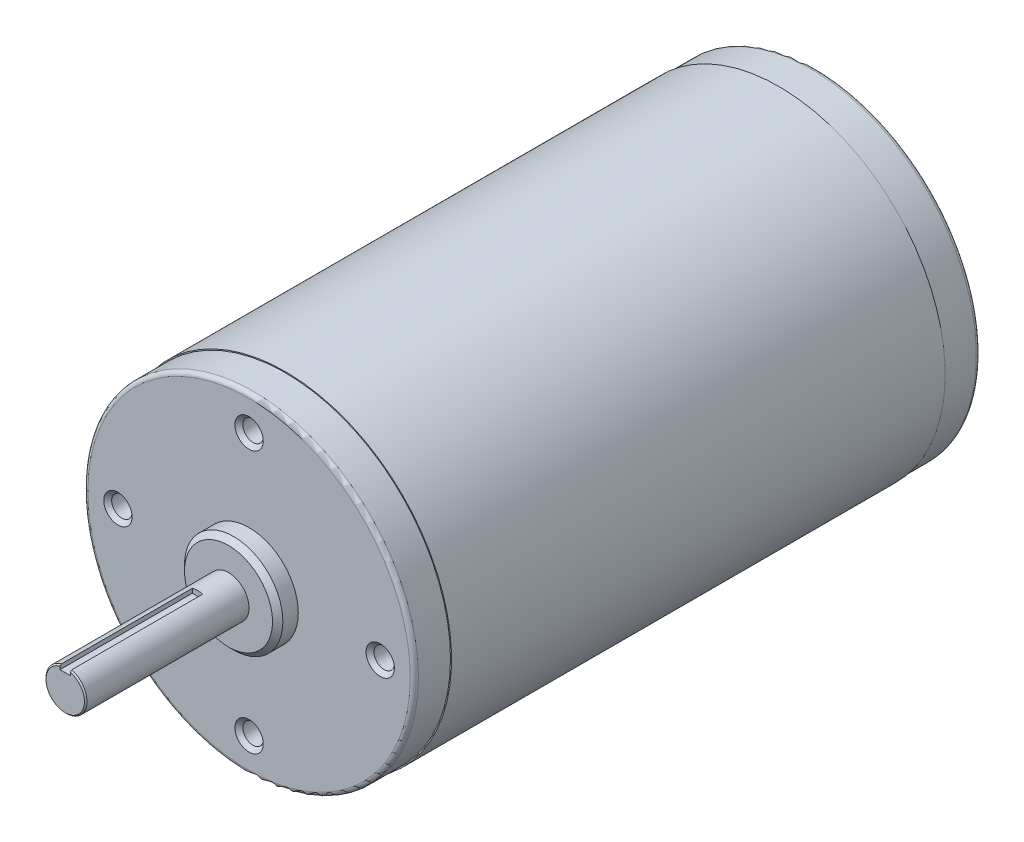
ISO-10303-21;
HEADER;
FILE_DESCRIPTION(('STEP AP214'),'2;1');
FILE_NAME('part.step','',(''),(''),'','','');
FILE_SCHEMA(('AUTOMOTIVE_DESIGN { 1 0 10303 214 1 1 1 1 }'));
ENDSEC;
DATA;
#1=APPLICATION_CONTEXT('core data for automotive mechanical design processes');
#2=APPLICATION_PROTOCOL_DEFINITION('international standard','automotive_design',2000,#1);
#3=PRODUCT_CONTEXT('',#1,'mechanical');
#4=PRODUCT('Part','Part','',(#3));
#5=PRODUCT_RELATED_PRODUCT_CATEGORY('part','',(#4));
#6=PRODUCT_DEFINITION_FORMATION('','',#4);
#7=PRODUCT_DEFINITION_CONTEXT('part definition',#1,'design');
#8=PRODUCT_DEFINITION('design','',#6,#7);
#9=PRODUCT_DEFINITION_SHAPE('','',#8);
#10=(LENGTH_UNIT() NAMED_UNIT(*) SI_UNIT(.MILLI.,.METRE.));
#11=(NAMED_UNIT(*) PLANE_ANGLE_UNIT() SI_UNIT($,.RADIAN.));
#12=(NAMED_UNIT(*) SI_UNIT($,.STERADIAN.) SOLID_ANGLE_UNIT());
#13=UNCERTAINTY_MEASURE_WITH_UNIT(LENGTH_MEASURE(1.E-05),#10,'distance_accuracy_value','');
#14=(GEOMETRIC_REPRESENTATION_CONTEXT(3) GLOBAL_UNCERTAINTY_ASSIGNED_CONTEXT((#13)) GLOBAL_UNIT_ASSIGNED_CONTEXT((#10,
#11,#12)) REPRESENTATION_CONTEXT('',''));
#15=CARTESIAN_POINT('',(0.,0.,0.));
#16=DIRECTION('',(0.,0.,1.));
#17=DIRECTION('',(1.,0.,0.));
#18=AXIS2_PLACEMENT_3D('',#15,#16,#17);
#19=CARTESIAN_POINT('',(0.,0.,42.6108));
#20=DIRECTION('',(0.,0.,-1.));
#21=DIRECTION('',(-1.,0.,0.));
#22=AXIS2_PLACEMENT_3D('',#19,#20,#21);
#23=PLANE('',#22);
#24=DIRECTION('',(0.,1.,0.));
#25=VECTOR('',#24,1.);
#26=CARTESIAN_POINT('',(1.00000000000001,0.,42.6108));
#27=LINE('',#26,#25);
#28=CARTESIAN_POINT('',(1.00000000000001,2.99999999999999,42.6108));
#29=VERTEX_POINT('',#28);
#30=CARTESIAN_POINT('',(1.00000000000001,3.58836592498397,42.6108000000454));
#31=VERTEX_POINT('',#30);
#32=EDGE_CURVE('E109',#29,#31,#27,.T.);
#33=ORIENTED_EDGE('',*,*,#32,.F.);
#34=DIRECTION('',(1.,0.,0.));
#35=VECTOR('',#34,1.);
#36=CARTESIAN_POINT('',(-0.999999999999988,2.99999999999999,42.6108));
#37=LINE('',#36,#35);
#38=CARTESIAN_POINT('',(-0.999999999999988,2.99999999999999,42.6108));
#39=VERTEX_POINT('',#38);
#40=EDGE_CURVE('E75',#29,#39,#37,.F.);
#41=ORIENTED_EDGE('',*,*,#40,.T.);
#42=DIRECTION('',(0.,1.,0.));
#43=VECTOR('',#42,1.);
#44=CARTESIAN_POINT('',(-0.999999999999988,0.,42.6108));
#45=LINE('',#44,#43);
#46=CARTESIAN_POINT('',(-0.999999999999988,3.58836592498397,42.6108000000454));
#47=VERTEX_POINT('',#46);
#48=EDGE_CURVE('E56',#47,#39,#45,.F.);
#49=ORIENTED_EDGE('',*,*,#48,.F.);
#50=CARTESIAN_POINT('',(0.,0.,42.6108000000909));
#51=DIRECTION('',(0.,0.,-1.));
#52=DIRECTION('',(-1.,0.,0.));
#53=AXIS2_PLACEMENT_3D('',#50,#51,#52);
#54=CIRCLE('',#53,3.72510000016746);
#55=EDGE_CURVE('E21',#31,#47,#54,.T.);
#56=ORIENTED_EDGE('',*,*,#55,.F.);
#57=EDGE_LOOP('',(#33,#41,#49,#56));
#58=FACE_BOUND('',#57,.T.);
#59=ADVANCED_FACE('F17',(#58),#23,.F.);
#60=CARTESIAN_POINT('',(-0.999999999999988,2.99999999999999,42.6108));
#61=DIRECTION('',(0.,-1.,0.));
#62=DIRECTION('',(0.,0.,-1.));
#63=AXIS2_PLACEMENT_3D('',#60,#61,#62);
#64=PLANE('',#63);
#65=DIRECTION('',(0.,0.,1.));
#66=VECTOR('',#65,1.);
#67=CARTESIAN_POINT('',(-0.999999999999988,2.99999999999999,42.6108));
#68=LINE('',#67,#66);
#69=CARTESIAN_POINT('',(-0.999999999999988,2.99999999999999,16.9822));
#70=VERTEX_POINT('',#69);
#71=EDGE_CURVE('E112',#70,#39,#68,.T.);
#72=ORIENTED_EDGE('',*,*,#71,.T.);
#73=ORIENTED_EDGE('',*,*,#40,.F.);
#74=DIRECTION('',(0.,0.,-1.));
#75=VECTOR('',#74,1.);
#76=CARTESIAN_POINT('',(1.00000000000001,2.99999999999999,42.6108));
#77=LINE('',#76,#75);
#78=CARTESIAN_POINT('',(1.00000000000001,2.99999999999999,16.9822));
#79=VERTEX_POINT('',#78);
#80=EDGE_CURVE('E71',#29,#79,#77,.T.);
#81=ORIENTED_EDGE('',*,*,#80,.T.);
#82=DIRECTION('',(1.,0.,0.));
#83=VECTOR('',#82,1.);
#84=CARTESIAN_POINT('',(0.,2.99999999999999,16.9822));
#85=LINE('',#84,#83);
#86=EDGE_CURVE('E74',#70,#79,#85,.T.);
#87=ORIENTED_EDGE('',*,*,#86,.F.);
#88=EDGE_LOOP('',(#72,#73,#81,#87));
#89=FACE_BOUND('',#88,.T.);
#90=ADVANCED_FACE('F73',(#89),#64,.F.);
#91=CARTESIAN_POINT('',(0.,0.,42.3607999999831));
#92=DIRECTION('',(0.,0.,-1.));
#93=DIRECTION('',(-1.,0.,0.));
#94=AXIS2_PLACEMENT_3D('',#91,#92,#93);
#95=CONICAL_SURFACE('',#94,3.97509999982049,0.785398162487954);
#96=CARTESIAN_POINT('',(1.00000000000001,3.84726136482105,42.3607999998986));
#97=CARTESIAN_POINT('',(1.00000000000001,3.80416108602024,42.4025173689466));
#98=CARTESIAN_POINT('',(1.00000000000001,3.76103632686847,42.4442093865898));
#99=CARTESIAN_POINT('',(1.00000000000001,3.6747378468958,42.5275427200003));
#100=CARTESIAN_POINT('',(1.00000000000001,3.63156412607381,42.5691840357664));
#101=CARTESIAN_POINT('',(1.00000000000001,3.58836592489976,42.6108000001266));
#102=B_SPLINE_CURVE_WITH_KNOTS('',3,(#96,#97,#98,#99,#100,#101),.UNSPECIFIED.,.F.,.F.,(4,2,4),
(0.,0.179949222514293,0.359898449062173),.UNSPECIFIED.);
#103=CARTESIAN_POINT('',(1.00000000000001,3.84726136487013,42.3607999999493));
#104=VERTEX_POINT('',#103);
#105=EDGE_CURVE('E89',#104,#31,#102,.T.);
#106=ORIENTED_EDGE('',*,*,#105,.T.);
#107=ORIENTED_EDGE('',*,*,#55,.T.);
#108=CARTESIAN_POINT('',(-0.999999999953149,3.58836592487288,42.6108000000988));
#109=CARTESIAN_POINT('',(-0.999999999976568,3.63156412606036,42.5691840357526));
#110=CARTESIAN_POINT('',(-0.999999999992181,3.67473784689131,42.5275427199957));
#111=CARTESIAN_POINT('',(-1.00000000000779,3.76103632687294,42.4442093865944));
#112=CARTESIAN_POINT('',(-1.00000000000779,3.80416108602471,42.4025173689513));
#113=CARTESIAN_POINT('',(-0.999999999999988,3.84726136482106,42.3607999998986));
#114=B_SPLINE_CURVE_WITH_KNOTS('',3,(#108,#109,#110,#111,#112,#113),.UNSPECIFIED.,.F.,.F.,(4,2,
4),(0.,0.17994922654793,0.359898449062241),.UNSPECIFIED.);
#115=CARTESIAN_POINT('',(-0.999999999999988,3.84726136487013,42.3607999999493));
#116=VERTEX_POINT('',#115);
#117=EDGE_CURVE('E82',#47,#116,#114,.T.);
#118=ORIENTED_EDGE('',*,*,#117,.T.);
#119=CARTESIAN_POINT('',(0.,0.,42.3608));
#120=DIRECTION('',(0.,0.,1.));
#121=DIRECTION('',(1.,0.,0.));
#122=AXIS2_PLACEMENT_3D('',#119,#120,#121);
#123=CIRCLE('',#122,3.9751);
#124=EDGE_CURVE('E92',#104,#116,#123,.F.);
#125=ORIENTED_EDGE('',*,*,#124,.F.);
#126=EDGE_LOOP('',(#106,#107,#118,#125));
#127=FACE_BOUND('',#126,.T.);
#128=ADVANCED_FACE('F200',(#127),#95,.T.);
#129=CARTESIAN_POINT('',(-0.999999999999988,3.84726136491921,42.6108));
#130=DIRECTION('',(-1.,0.,0.));
#131=DIRECTION('',(0.,0.,1.));
#132=AXIS2_PLACEMENT_3D('',#129,#130,#131);
#133=PLANE('',#132);
#134=ORIENTED_EDGE('',*,*,#48,.T.);
#135=ORIENTED_EDGE('',*,*,#71,.F.);
#136=DIRECTION('',(0.,1.,0.));
#137=VECTOR('',#136,1.);
#138=CARTESIAN_POINT('',(-0.999999999999988,3.45234055060212,16.9822));
#139=LINE('',#138,#137);
#140=CARTESIAN_POINT('',(-0.999999999999988,3.84726136491921,16.9822));
#141=VERTEX_POINT('',#140);
#142=EDGE_CURVE('E78',#141,#70,#139,.F.);
#143=ORIENTED_EDGE('',*,*,#142,.F.);
#144=DIRECTION('',(0.,0.,1.));
#145=VECTOR('',#144,1.);
#146=CARTESIAN_POINT('',(-0.999999999999988,3.84726136491921,10.9878));
#147=LINE('',#146,#145);
#148=EDGE_CURVE('E101',#116,#141,#147,.F.);
#149=ORIENTED_EDGE('',*,*,#148,.F.);
#150=ORIENTED_EDGE('',*,*,#117,.F.);
#151=EDGE_LOOP('',(#134,#135,#143,#149,#150));
#152=FACE_BOUND('',#151,.T.);
#153=ADVANCED_FACE('F204',(#152),#133,.F.);
#154=CARTESIAN_POINT('',(0.,3.45234055060212,16.9822));
#155=DIRECTION('',(0.,0.,1.));
#156=DIRECTION('',(1.,0.,0.));
#157=AXIS2_PLACEMENT_3D('',#154,#155,#156);
#158=PLANE('',#157);
#159=CARTESIAN_POINT('',(0.,0.,16.9822));
#160=DIRECTION('',(0.,0.,1.));
#161=DIRECTION('',(1.,0.,0.));
#162=AXIS2_PLACEMENT_3D('',#159,#160,#161);
#163=CIRCLE('',#162,3.9751);
#164=CARTESIAN_POINT('',(1.00000000000001,3.8472613649192,16.9822));
#165=VERTEX_POINT('',#164);
#166=EDGE_CURVE('E187',#141,#165,#163,.F.);
#167=ORIENTED_EDGE('',*,*,#166,.F.);
#168=ORIENTED_EDGE('',*,*,#142,.T.);
#169=ORIENTED_EDGE('',*,*,#86,.T.);
#170=DIRECTION('',(0.,1.,0.));
#171=VECTOR('',#170,1.);
#172=CARTESIAN_POINT('',(1.00000000000001,2.99999999999999,16.9822));
#173=LINE('',#172,#171);
#174=EDGE_CURVE('E36',#79,#165,#173,.T.);
#175=ORIENTED_EDGE('',*,*,#174,.T.);
#176=EDGE_LOOP('',(#167,#168,#169,#175));
#177=FACE_BOUND('',#176,.T.);
#178=ADVANCED_FACE('F81',(#177),#158,.T.);
#179=CARTESIAN_POINT('',(1.00000000000001,2.99999999999999,42.6108));
#180=DIRECTION('',(1.,0.,0.));
#181=DIRECTION('',(0.,0.,-1.));
#182=AXIS2_PLACEMENT_3D('',#179,#180,#181);
#183=PLANE('',#182);
#184=DIRECTION('',(0.,0.,1.));
#185=VECTOR('',#184,1.);
#186=CARTESIAN_POINT('',(1.00000000000001,3.8472613649192,10.9878));
#187=LINE('',#186,#185);
#188=EDGE_CURVE('E87',#165,#104,#187,.T.);
#189=ORIENTED_EDGE('',*,*,#188,.F.);
#190=ORIENTED_EDGE('',*,*,#174,.F.);
#191=ORIENTED_EDGE('',*,*,#80,.F.);
#192=ORIENTED_EDGE('',*,*,#32,.T.);
#193=ORIENTED_EDGE('',*,*,#105,.F.);
#194=EDGE_LOOP('',(#189,#190,#191,#192,#193));
#195=FACE_BOUND('',#194,.T.);
#196=ADVANCED_FACE('F84',(#195),#183,.F.);
#197=CARTESIAN_POINT('',(0.,25.4,-98.0336));
#198=DIRECTION('',(0.,0.,1.));
#199=DIRECTION('',(1.,0.,0.));
#200=AXIS2_PLACEMENT_3D('',#197,#198,#199);
#201=CYLINDRICAL_SURFACE('',#200,2.54);
#202=CARTESIAN_POINT('',(0.,25.4,-94.9856));
#203=DIRECTION('',(0.,0.,1.));
#204=DIRECTION('',(1.,0.,0.));
#205=AXIS2_PLACEMENT_3D('',#202,#203,#204);
#206=CIRCLE('',#205,2.53999999999997);
#207=CARTESIAN_POINT('',(2.53999999999998,25.4,-94.9856));
#208=VERTEX_POINT('',#207);
#209=EDGE_CURVE('E180',#208,#208,#206,.T.);
#210=ORIENTED_EDGE('',*,*,#209,.T.);
#211=EDGE_LOOP('',(#210));
#212=FACE_BOUND('',#211,.T.);
#213=CARTESIAN_POINT('',(0.,25.4,-98.0336));
#214=DIRECTION('',(0.,0.,1.));
#215=DIRECTION('',(1.,0.,0.));
#216=AXIS2_PLACEMENT_3D('',#213,#214,#215);
#217=CIRCLE('',#216,2.54);
#218=CARTESIAN_POINT('',(2.54,25.4,-98.0336));
#219=VERTEX_POINT('',#218);
#220=EDGE_CURVE('E181',#219,#219,#217,.F.);
#221=ORIENTED_EDGE('',*,*,#220,.T.);
#222=EDGE_LOOP('',(#221));
#223=FACE_BOUND('',#222,.T.);
#224=ADVANCED_FACE('F212',(#212,#223),#201,.F.);
#225=CARTESIAN_POINT('',(0.,0.,10.9878));
#226=DIRECTION('',(0.,0.,1.));
#227=DIRECTION('',(1.,0.,0.));
#228=AXIS2_PLACEMENT_3D('',#225,#226,#227);
#229=CYLINDRICAL_SURFACE('',#228,3.9751);
#230=CARTESIAN_POINT('',(0.,0.,10.9878));
#231=DIRECTION('',(0.,0.,1.));
#232=DIRECTION('',(1.,0.,0.));
#233=AXIS2_PLACEMENT_3D('',#230,#231,#232);
#234=CIRCLE('',#233,3.9751);
#235=CARTESIAN_POINT('',(3.9751,0.,10.9878));
#236=VERTEX_POINT('',#235);
#237=EDGE_CURVE('E177',#236,#236,#234,.T.);
#238=ORIENTED_EDGE('',*,*,#237,.T.);
#239=EDGE_LOOP('',(#238));
#240=FACE_BOUND('',#239,.T.);
#241=ORIENTED_EDGE('',*,*,#166,.T.);
#242=ORIENTED_EDGE('',*,*,#188,.T.);
#243=ORIENTED_EDGE('',*,*,#124,.T.);
#244=ORIENTED_EDGE('',*,*,#148,.T.);
#245=EDGE_LOOP('',(#241,#242,#243,#244));
#246=FACE_BOUND('',#245,.T.);
#247=ADVANCED_FACE('F215',(#240,#246),#229,.T.);
#248=CARTESIAN_POINT('',(0.,-25.4,-98.0336));
#249=DIRECTION('',(0.,0.,1.));
#250=DIRECTION('',(1.,0.,0.));
#251=AXIS2_PLACEMENT_3D('',#248,#249,#250);
#252=CYLINDRICAL_SURFACE('',#251,2.54);
#253=CARTESIAN_POINT('',(0.,-25.4,-94.9856));
#254=DIRECTION('',(0.,0.,1.));
#255=DIRECTION('',(1.,0.,0.));
#256=AXIS2_PLACEMENT_3D('',#253,#254,#255);
#257=CIRCLE('',#256,2.53999999999997);
#258=CARTESIAN_POINT('',(2.53999999999997,-25.4,-94.9856));
#259=VERTEX_POINT('',#258);
#260=EDGE_CURVE('E176',#259,#259,#257,.T.);
#261=ORIENTED_EDGE('',*,*,#260,.T.);
#262=EDGE_LOOP('',(#261));
#263=FACE_BOUND('',#262,.T.);
#264=CARTESIAN_POINT('',(0.,-25.4,-98.0336));
#265=DIRECTION('',(0.,0.,1.));
#266=DIRECTION('',(1.,0.,0.));
#267=AXIS2_PLACEMENT_3D('',#264,#265,#266);
#268=CIRCLE('',#267,2.54);
#269=CARTESIAN_POINT('',(2.54,-25.4,-98.0336));
#270=VERTEX_POINT('',#269);
#271=EDGE_CURVE('E184',#270,#270,#268,.F.);
#272=ORIENTED_EDGE('',*,*,#271,.T.);
#273=EDGE_LOOP('',(#272));
#274=FACE_BOUND('',#273,.T.);
#275=ADVANCED_FACE('F217',(#263,#274),#252,.F.);
#276=CARTESIAN_POINT('',(-5.05206,-30.45206,-98.0336));
#277=DIRECTION('',(0.,0.,1.));
#278=DIRECTION('',(1.,0.,0.));
#279=AXIS2_PLACEMENT_3D('',#276,#277,#278);
#280=PLANE('',#279);
#281=ORIENTED_EDGE('',*,*,#271,.F.);
#282=EDGE_LOOP('',(#281));
#283=FACE_BOUND('',#282,.T.);
#284=CARTESIAN_POINT('',(0.,-25.4,-98.0336));
#285=DIRECTION('',(0.,0.,1.));
#286=DIRECTION('',(1.,0.,0.));
#287=AXIS2_PLACEMENT_3D('',#284,#285,#286);
#288=CIRCLE('',#287,4.953);
#289=CARTESIAN_POINT('',(4.953,-25.4,-98.0336));
#290=VERTEX_POINT('',#289);
#291=EDGE_CURVE('E173',#290,#290,#288,.F.);
#292=ORIENTED_EDGE('',*,*,#291,.T.);
#293=EDGE_LOOP('',(#292));
#294=FACE_BOUND('',#293,.T.);
#295=ADVANCED_FACE('F220',(#283,#294),#280,.F.);
#296=CARTESIAN_POINT('',(0.,0.,-106.7204));
#297=DIRECTION('',(0.,0.,1.));
#298=DIRECTION('',(1.,0.,0.));
#299=AXIS2_PLACEMENT_3D('',#296,#297,#298);
#300=PLANE('',#299);
#301=CARTESIAN_POINT('',(0.,0.,-106.7204));
#302=DIRECTION('',(0.,0.,1.));
#303=DIRECTION('',(-1.,0.,0.));
#304=AXIS2_PLACEMENT_3D('',#301,#302,#303);
#305=CIRCLE('',#304,14.3129);
#306=CARTESIAN_POINT('',(-14.3129,0.,-106.7204));
#307=VERTEX_POINT('',#306);
#308=EDGE_CURVE('E172',#307,#307,#305,.T.);
#309=ORIENTED_EDGE('',*,*,#308,.F.);
#310=EDGE_LOOP('',(#309));
#311=FACE_BOUND('',#310,.T.);
#312=ADVANCED_FACE('F224',(#311),#300,.F.);
#313=CARTESIAN_POINT('',(5.05206,30.45206,-98.0336));
#314=DIRECTION('',(0.,0.,1.));
#315=DIRECTION('',(-1.,0.,0.));
#316=AXIS2_PLACEMENT_3D('',#313,#314,#315);
#317=PLANE('',#316);
#318=ORIENTED_EDGE('',*,*,#220,.F.);
#319=EDGE_LOOP('',(#318));
#320=FACE_BOUND('',#319,.T.);
#321=CARTESIAN_POINT('',(0.,25.4,-98.0336));
#322=DIRECTION('',(0.,0.,1.));
#323=DIRECTION('',(1.,0.,0.));
#324=AXIS2_PLACEMENT_3D('',#321,#322,#323);
#325=CIRCLE('',#324,4.953);
#326=CARTESIAN_POINT('',(4.953,25.4,-98.0336));
#327=VERTEX_POINT('',#326);
#328=EDGE_CURVE('E169',#327,#327,#325,.F.);
#329=ORIENTED_EDGE('',*,*,#328,.T.);
#330=EDGE_LOOP('',(#329));
#331=FACE_BOUND('',#330,.T.);
#332=ADVANCED_FACE('F226',(#320,#331),#317,.F.);
#333=CARTESIAN_POINT('',(0.,25.4,-94.9856));
#334=DIRECTION('',(0.,0.,-1.));
#335=DIRECTION('',(-1.,0.,0.));
#336=AXIS2_PLACEMENT_3D('',#333,#334,#335);
#337=CONICAL_SURFACE('',#336,2.53999999999997,1.02974425867669);
#338=ORIENTED_EDGE('',*,*,#209,.F.);
#339=EDGE_LOOP('',(#338));
#340=FACE_BOUND('',#339,.T.);
#341=CARTESIAN_POINT('',(0.,25.4,-94.6498390860874));
#342=DIRECTION('',(0.,0.,1.));
#343=DIRECTION('',(1.,0.,0.));
#344=AXIS2_PLACEMENT_3D('',#341,#342,#343);
#345=CIRCLE('',#344,1.9812);
#346=CARTESIAN_POINT('',(1.9812,25.4,-94.6498390860874));
#347=VERTEX_POINT('',#346);
#348=EDGE_CURVE('E168',#347,#347,#345,.T.);
#349=ORIENTED_EDGE('',*,*,#348,.T.);
#350=EDGE_LOOP('',(#349));
#351=FACE_BOUND('',#350,.T.);
#352=ADVANCED_FACE('F229',(#340,#351),#337,.F.);
#353=CARTESIAN_POINT('',(0.,0.,-95.6056));
#354=DIRECTION('',(0.,0.,1.));
#355=DIRECTION('',(1.,0.,0.));
#356=AXIS2_PLACEMENT_3D('',#353,#354,#355);
#357=PLANE('',#356);
#358=CARTESIAN_POINT('',(25.4,0.,-95.6056));
#359=DIRECTION('',(0.,0.,-1.));
#360=DIRECTION('',(-1.,0.,0.));
#361=AXIS2_PLACEMENT_3D('',#358,#359,#360);
#362=CIRCLE('',#361,1.9812);
#363=CARTESIAN_POINT('',(23.4188,0.,-95.6056));
#364=VERTEX_POINT('',#363);
#365=EDGE_CURVE('E165',#364,#364,#362,.F.);
#366=ORIENTED_EDGE('',*,*,#365,.T.);
#367=EDGE_LOOP('',(#366));
#368=FACE_BOUND('',#367,.T.);
#369=ADVANCED_FACE('F233',(#368),#357,.T.);
#370=CARTESIAN_POINT('',(0.,0.,10.9878));
#371=DIRECTION('',(0.,0.,-1.));
#372=DIRECTION('',(-1.,0.,0.));
#373=AXIS2_PLACEMENT_3D('',#370,#371,#372);
#374=PLANE('',#373);
#375=ORIENTED_EDGE('',*,*,#237,.F.);
#376=EDGE_LOOP('',(#375));
#377=FACE_BOUND('',#376,.T.);
#378=CARTESIAN_POINT('',(0.,0.,10.9878000004487));
#379=DIRECTION('',(0.,0.,-1.));
#380=DIRECTION('',(-1.,0.,0.));
#381=AXIS2_PLACEMENT_3D('',#378,#379,#380);
#382=CIRCLE('',#381,8.52500000044874);
#383=CARTESIAN_POINT('',(-8.52500000044874,0.,10.9878000004487));
#384=VERTEX_POINT('',#383);
#385=EDGE_CURVE('E162',#384,#384,#382,.T.);
#386=ORIENTED_EDGE('',*,*,#385,.F.);
#387=EDGE_LOOP('',(#386));
#388=FACE_BOUND('',#387,.T.);
#389=ADVANCED_FACE('F239',(#377,#388),#374,.F.);
#390=CARTESIAN_POINT('',(0.,-25.4,-94.9856));
#391=DIRECTION('',(0.,0.,-1.));
#392=DIRECTION('',(-1.,0.,0.));
#393=AXIS2_PLACEMENT_3D('',#390,#391,#392);
#394=CONICAL_SURFACE('',#393,2.53999999999997,1.02974425867669);
#395=ORIENTED_EDGE('',*,*,#260,.F.);
#396=EDGE_LOOP('',(#395));
#397=FACE_BOUND('',#396,.T.);
#398=CARTESIAN_POINT('',(0.,-25.4,-94.6498390860874));
#399=DIRECTION('',(0.,0.,1.));
#400=DIRECTION('',(1.,0.,0.));
#401=AXIS2_PLACEMENT_3D('',#398,#399,#400);
#402=CIRCLE('',#401,1.9812);
#403=CARTESIAN_POINT('',(1.98119999999999,-25.4,-94.6498390860874));
#404=VERTEX_POINT('',#403);
#405=EDGE_CURVE('E161',#404,#404,#402,.T.);
#406=ORIENTED_EDGE('',*,*,#405,.T.);
#407=EDGE_LOOP('',(#406));
#408=FACE_BOUND('',#407,.T.);
#409=ADVANCED_FACE('F235',(#397,#408),#394,.F.);
#410=CARTESIAN_POINT('',(0.,0.,0.));
#411=DIRECTION('',(0.,0.,1.));
#412=DIRECTION('',(1.,0.,0.));
#413=AXIS2_PLACEMENT_3D('',#410,#411,#412);
#414=PLANE('',#413);
#415=CARTESIAN_POINT('',(-25.4,0.,0.));
#416=DIRECTION('',(0.,0.,-1.));
#417=DIRECTION('',(0.,1.,0.));
#418=AXIS2_PLACEMENT_3D('',#415,#416,#417);
#419=CIRCLE('',#418,1.9812);
#420=CARTESIAN_POINT('',(-25.4,1.9812,0.));
#421=VERTEX_POINT('',#420);
#422=EDGE_CURVE('E157',#421,#421,#419,.F.);
#423=ORIENTED_EDGE('',*,*,#422,.T.);
#424=EDGE_LOOP('',(#423));
#425=FACE_BOUND('',#424,.T.);
#426=ADVANCED_FACE('F238',(#425),#414,.T.);
#427=CARTESIAN_POINT('',(0.,-25.4,-102.0976));
#428=DIRECTION('',(0.,0.,1.));
#429=DIRECTION('',(1.,0.,0.));
#430=AXIS2_PLACEMENT_3D('',#427,#428,#429);
#431=CYLINDRICAL_SURFACE('',#430,4.953);
#432=CARTESIAN_POINT('',(0.,-25.4,-102.097599999809));
#433=DIRECTION('',(0.,0.,-1.));
#434=DIRECTION('',(-1.,0.,0.));
#435=AXIS2_PLACEMENT_3D('',#432,#433,#434);
#436=CIRCLE('',#435,4.9530000002278);
#437=CARTESIAN_POINT('',(-4.9530000002278,-25.4,-102.097599999809));
#438=VERTEX_POINT('',#437);
#439=EDGE_CURVE('E160',#438,#438,#436,.T.);
#440=ORIENTED_EDGE('',*,*,#439,.T.);
#441=EDGE_LOOP('',(#440));
#442=FACE_BOUND('',#441,.T.);
#443=ORIENTED_EDGE('',*,*,#291,.F.);
#444=EDGE_LOOP('',(#443));
#445=FACE_BOUND('',#444,.T.);
#446=ADVANCED_FACE('F241',(#442,#445),#431,.F.);
#447=CARTESIAN_POINT('',(0.,0.,-105.9584));
#448=DIRECTION('',(0.,0.,1.));
#449=DIRECTION('',(1.,0.,0.));
#450=AXIS2_PLACEMENT_3D('',#447,#448,#449);
#451=TOROIDAL_SURFACE('',#450,14.3129,0.762);
#452=CARTESIAN_POINT('',(0.,0.,-105.9584));
#453=DIRECTION('',(0.,0.,-1.));
#454=DIRECTION('',(-1.,0.,0.));
#455=AXIS2_PLACEMENT_3D('',#452,#453,#454);
#456=CIRCLE('',#455,15.0749);
#457=CARTESIAN_POINT('',(-15.0749,0.,-105.9584));
#458=VERTEX_POINT('',#457);
#459=EDGE_CURVE('E386',#458,#458,#456,.F.);
#460=ORIENTED_EDGE('',*,*,#459,.F.);
#461=EDGE_LOOP('',(#460));
#462=FACE_BOUND('',#461,.T.);
#463=ORIENTED_EDGE('',*,*,#308,.T.);
#464=EDGE_LOOP('',(#463));
#465=FACE_BOUND('',#464,.T.);
#466=ADVANCED_FACE('F244',(#462,#465),#451,.T.);
#467=CARTESIAN_POINT('',(0.,25.4,-102.0976));
#468=DIRECTION('',(0.,0.,1.));
#469=DIRECTION('',(1.,0.,0.));
#470=AXIS2_PLACEMENT_3D('',#467,#468,#469);
#471=CYLINDRICAL_SURFACE('',#470,4.953);
#472=CARTESIAN_POINT('',(0.,25.4,-102.097599999809));
#473=DIRECTION('',(0.,0.,-1.));
#474=DIRECTION('',(1.,0.,0.));
#475=AXIS2_PLACEMENT_3D('',#472,#473,#474);
#476=CIRCLE('',#475,4.9530000002278);
#477=CARTESIAN_POINT('',(4.9530000002278,25.4,-102.097599999809));
#478=VERTEX_POINT('',#477);
#479=EDGE_CURVE('E381',#478,#478,#476,.T.);
#480=ORIENTED_EDGE('',*,*,#479,.T.);
#481=EDGE_LOOP('',(#480));
#482=FACE_BOUND('',#481,.T.);
#483=ORIENTED_EDGE('',*,*,#328,.F.);
#484=EDGE_LOOP('',(#483));
#485=FACE_BOUND('',#484,.T.);
#486=ADVANCED_FACE('F246',(#482,#485),#471,.F.);
#487=CARTESIAN_POINT('',(0.,25.4,6.23799999999999));
#488=DIRECTION('',(0.,0.,-1.));
#489=DIRECTION('',(-1.,0.,0.));
#490=AXIS2_PLACEMENT_3D('',#487,#488,#489);
#491=CYLINDRICAL_SURFACE('',#490,1.9812);
#492=CARTESIAN_POINT('',(0.,25.4,6.23799999959829));
#493=DIRECTION('',(0.,0.,1.));
#494=DIRECTION('',(0.,-1.,0.));
#495=AXIS2_PLACEMENT_3D('',#492,#493,#494);
#496=CIRCLE('',#495,1.98120000033932);
#497=CARTESIAN_POINT('',(0.,23.4187999996607,6.23799999959829));
#498=VERTEX_POINT('',#497);
#499=EDGE_CURVE('E376',#498,#498,#496,.T.);
#500=ORIENTED_EDGE('',*,*,#499,.T.);
#501=EDGE_LOOP('',(#500));
#502=FACE_BOUND('',#501,.T.);
#503=ORIENTED_EDGE('',*,*,#348,.F.);
#504=EDGE_LOOP('',(#503));
#505=FACE_BOUND('',#504,.T.);
#506=ADVANCED_FACE('F249',(#502,#505),#491,.F.);
#507=CARTESIAN_POINT('',(25.4,0.,6.23799999999999));
#508=DIRECTION('',(0.,0.,-1.));
#509=DIRECTION('',(-1.,0.,0.));
#510=AXIS2_PLACEMENT_3D('',#507,#508,#509);
#511=CYLINDRICAL_SURFACE('',#510,1.9812);
#512=CARTESIAN_POINT('',(25.4,0.,6.23799999959829));
#513=DIRECTION('',(0.,0.,1.));
#514=DIRECTION('',(-1.,0.,0.));
#515=AXIS2_PLACEMENT_3D('',#512,#513,#514);
#516=CIRCLE('',#515,1.98120000033932);
#517=CARTESIAN_POINT('',(23.4187999996607,0.,6.23799999959829));
#518=VERTEX_POINT('',#517);
#519=EDGE_CURVE('E371',#518,#518,#516,.T.);
#520=ORIENTED_EDGE('',*,*,#519,.T.);
#521=EDGE_LOOP('',(#520));
#522=FACE_BOUND('',#521,.T.);
#523=ORIENTED_EDGE('',*,*,#365,.F.);
#524=EDGE_LOOP('',(#523));
#525=FACE_BOUND('',#524,.T.);
#526=ADVANCED_FACE('F253',(#522,#525),#511,.F.);
#527=CARTESIAN_POINT('',(0.,0.,9.98779999955128));
#528=DIRECTION('',(0.,0.,-1.));
#529=DIRECTION('',(-1.,0.,0.));
#530=AXIS2_PLACEMENT_3D('',#527,#528,#529);
#531=CONICAL_SURFACE('',#530,9.52499999955128,0.7853981625);
#532=CARTESIAN_POINT('',(0.,0.,9.9878));
#533=DIRECTION('',(0.,0.,1.));
#534=DIRECTION('',(1.,0.,0.));
#535=AXIS2_PLACEMENT_3D('',#532,#533,#534);
#536=CIRCLE('',#535,9.525);
#537=CARTESIAN_POINT('',(9.525,0.,9.9878));
#538=VERTEX_POINT('',#537);
#539=EDGE_CURVE('E366',#538,#538,#536,.F.);
#540=ORIENTED_EDGE('',*,*,#539,.F.);
#541=EDGE_LOOP('',(#540));
#542=FACE_BOUND('',#541,.T.);
#543=ORIENTED_EDGE('',*,*,#385,.T.);
#544=EDGE_LOOP('',(#543));
#545=FACE_BOUND('',#544,.T.);
#546=ADVANCED_FACE('F256',(#542,#545),#531,.T.);
#547=CARTESIAN_POINT('',(0.,-25.4,6.23799999999999));
#548=DIRECTION('',(0.,0.,-1.));
#549=DIRECTION('',(-1.,0.,0.));
#550=AXIS2_PLACEMENT_3D('',#547,#548,#549);
#551=CYLINDRICAL_SURFACE('',#550,1.9812);
#552=CARTESIAN_POINT('',(0.,-25.4,6.23799999959829));
#553=DIRECTION('',(0.,0.,1.));
#554=DIRECTION('',(0.,1.,0.));
#555=AXIS2_PLACEMENT_3D('',#552,#553,#554);
#556=CIRCLE('',#555,1.98120000033932);
#557=CARTESIAN_POINT('',(0.,-23.4187999996607,6.23799999959829));
#558=VERTEX_POINT('',#557);
#559=EDGE_CURVE('E362',#558,#558,#556,.T.);
#560=ORIENTED_EDGE('',*,*,#559,.T.);
#561=EDGE_LOOP('',(#560));
#562=FACE_BOUND('',#561,.T.);
#563=ORIENTED_EDGE('',*,*,#405,.F.);
#564=EDGE_LOOP('',(#563));
#565=FACE_BOUND('',#564,.T.);
#566=ADVANCED_FACE('F258',(#562,#565),#551,.F.);
#567=CARTESIAN_POINT('',(-25.4,0.,6.23799999999999));
#568=DIRECTION('',(0.,0.,-1.));
#569=DIRECTION('',(0.,1.,0.));
#570=AXIS2_PLACEMENT_3D('',#567,#568,#569);
#571=CYLINDRICAL_SURFACE('',#570,1.9812);
#572=CARTESIAN_POINT('',(-25.4,0.,6.23799999959829));
#573=DIRECTION('',(0.,0.,1.));
#574=DIRECTION('',(1.,0.,0.));
#575=AXIS2_PLACEMENT_3D('',#572,#573,#574);
#576=CIRCLE('',#575,1.98120000033932);
#577=CARTESIAN_POINT('',(-23.4187999996607,0.,6.23799999959829));
#578=VERTEX_POINT('',#577);
#579=EDGE_CURVE('E156',#578,#578,#576,.T.);
#580=ORIENTED_EDGE('',*,*,#579,.T.);
#581=EDGE_LOOP('',(#580));
#582=FACE_BOUND('',#581,.T.);
#583=ORIENTED_EDGE('',*,*,#422,.F.);
#584=EDGE_LOOP('',(#583));
#585=FACE_BOUND('',#584,.T.);
#586=ADVANCED_FACE('F19',(#582,#585),#571,.F.);
#587=CARTESIAN_POINT('',(0.,-25.4,-102.605600000174));
#588=DIRECTION('',(0.,0.,-1.));
#589=DIRECTION('',(0.,1.,0.));
#590=AXIS2_PLACEMENT_3D('',#587,#588,#589);
#591=CONICAL_SURFACE('',#590,5.46099999962735,0.785398162502275);
#592=CARTESIAN_POINT('',(0.,-25.4,-102.605600000288));
#593=DIRECTION('',(0.,0.,-1.));
#594=DIRECTION('',(0.,1.,0.));
#595=AXIS2_PLACEMENT_3D('',#592,#593,#594);
#596=CIRCLE('',#595,5.46099999974103);
#597=CARTESIAN_POINT('',(0.,-19.939000000259,-102.605600000288));
#598=VERTEX_POINT('',#597);
#599=EDGE_CURVE('E153',#598,#598,#596,.T.);
#600=ORIENTED_EDGE('',*,*,#599,.T.);
#601=EDGE_LOOP('',(#600));
#602=FACE_BOUND('',#601,.T.);
#603=ORIENTED_EDGE('',*,*,#439,.F.);
#604=EDGE_LOOP('',(#603));
#605=FACE_BOUND('',#604,.T.);
#606=ADVANCED_FACE('F266',(#602,#605),#591,.F.);
#607=CARTESIAN_POINT('',(0.,0.,-102.6056));
#608=DIRECTION('',(0.,0.,-1.));
#609=DIRECTION('',(-1.,0.,0.));
#610=AXIS2_PLACEMENT_3D('',#607,#608,#609);
#611=CYLINDRICAL_SURFACE('',#610,15.0749);
#612=ORIENTED_EDGE('',*,*,#459,.T.);
#613=EDGE_LOOP('',(#612));
#614=FACE_BOUND('',#613,.T.);
#615=CARTESIAN_POINT('',(0.,0.,-102.6056));
#616=DIRECTION('',(0.,0.,-1.));
#617=DIRECTION('',(-1.,0.,0.));
#618=AXIS2_PLACEMENT_3D('',#615,#616,#617);
#619=CIRCLE('',#618,15.0749);
#620=CARTESIAN_POINT('',(-15.0749,0.,-102.6056));
#621=VERTEX_POINT('',#620);
#622=EDGE_CURVE('E150',#621,#621,#619,.T.);
#623=ORIENTED_EDGE('',*,*,#622,.T.);
#624=EDGE_LOOP('',(#623));
#625=FACE_BOUND('',#624,.T.);
#626=ADVANCED_FACE('F545',(#614,#625),#611,.T.);
#627=CARTESIAN_POINT('',(0.,25.4,-102.605600000174));
#628=DIRECTION('',(0.,0.,-1.));
#629=DIRECTION('',(0.,1.,0.));
#630=AXIS2_PLACEMENT_3D('',#627,#628,#629);
#631=CONICAL_SURFACE('',#630,5.46099999962734,0.785398162502276);
#632=CARTESIAN_POINT('',(0.,25.4,-102.605600000288));
#633=DIRECTION('',(0.,0.,-1.));
#634=DIRECTION('',(0.,1.,0.));
#635=AXIS2_PLACEMENT_3D('',#632,#633,#634);
#636=CIRCLE('',#635,5.46099999974103);
#637=CARTESIAN_POINT('',(0.,30.860999999741,-102.605600000288));
#638=VERTEX_POINT('',#637);
#639=EDGE_CURVE('E147',#638,#638,#636,.T.);
#640=ORIENTED_EDGE('',*,*,#639,.T.);
#641=EDGE_LOOP('',(#640));
#642=FACE_BOUND('',#641,.T.);
#643=ORIENTED_EDGE('',*,*,#479,.F.);
#644=EDGE_LOOP('',(#643));
#645=FACE_BOUND('',#644,.T.);
#646=ADVANCED_FACE('F554',(#642,#645),#631,.F.);
#647=CARTESIAN_POINT('',(0.,25.4,7.00000000034606));
#648=DIRECTION('',(0.,0.,1.));
#649=DIRECTION('',(1.,0.,0.));
#650=AXIS2_PLACEMENT_3D('',#647,#648,#649);
#651=CONICAL_SURFACE('',#650,2.74319999966602,0.785398162464978);
#652=CARTESIAN_POINT('',(0.,25.4,7.00000000034606));
#653=DIRECTION('',(0.,0.,1.));
#654=DIRECTION('',(1.,0.,0.));
#655=AXIS2_PLACEMENT_3D('',#652,#653,#654);
#656=CIRCLE('',#655,2.74319999966602);
#657=CARTESIAN_POINT('',(2.74319999966602,25.4,7.00000000034606));
#658=VERTEX_POINT('',#657);
#659=EDGE_CURVE('E144',#658,#658,#656,.T.);
#660=ORIENTED_EDGE('',*,*,#659,.T.);
#661=EDGE_LOOP('',(#660));
#662=FACE_BOUND('',#661,.T.);
#663=ORIENTED_EDGE('',*,*,#499,.F.);
#664=EDGE_LOOP('',(#663));
#665=FACE_BOUND('',#664,.T.);
#666=ADVANCED_FACE('F564',(#662,#665),#651,.F.);
#667=CARTESIAN_POINT('',(25.4,0.,7.00000000034606));
#668=DIRECTION('',(0.,0.,1.));
#669=DIRECTION('',(1.,0.,0.));
#670=AXIS2_PLACEMENT_3D('',#667,#668,#669);
#671=CONICAL_SURFACE('',#670,2.74319999966602,0.785398162464978);
#672=CARTESIAN_POINT('',(25.4,0.,7.00000000034606));
#673=DIRECTION('',(0.,0.,1.));
#674=DIRECTION('',(1.,0.,0.));
#675=AXIS2_PLACEMENT_3D('',#672,#673,#674);
#676=CIRCLE('',#675,2.74319999966602);
#677=CARTESIAN_POINT('',(28.143199999666,0.,7.00000000034606));
#678=VERTEX_POINT('',#677);
#679=EDGE_CURVE('E141',#678,#678,#676,.T.);
#680=ORIENTED_EDGE('',*,*,#679,.T.);
#681=EDGE_LOOP('',(#680));
#682=FACE_BOUND('',#681,.T.);
#683=ORIENTED_EDGE('',*,*,#519,.F.);
#684=EDGE_LOOP('',(#683));
#685=FACE_BOUND('',#684,.T.);
#686=ADVANCED_FACE('F574',(#682,#685),#671,.F.);
#687=CARTESIAN_POINT('',(0.,0.,6.99999999999999));
#688=DIRECTION('',(0.,0.,1.));
#689=DIRECTION('',(1.,0.,0.));
#690=AXIS2_PLACEMENT_3D('',#687,#688,#689);
#691=CYLINDRICAL_SURFACE('',#690,9.525);
#692=ORIENTED_EDGE('',*,*,#539,.T.);
#693=EDGE_LOOP('',(#692));
#694=FACE_BOUND('',#693,.T.);
#695=CARTESIAN_POINT('',(0.,0.,6.99999999999999));
#696=DIRECTION('',(0.,0.,1.));
#697=DIRECTION('',(1.,0.,0.));
#698=AXIS2_PLACEMENT_3D('',#695,#696,#697);
#699=CIRCLE('',#698,9.525);
#700=CARTESIAN_POINT('',(9.525,0.,6.99999999999999));
#701=VERTEX_POINT('',#700);
#702=EDGE_CURVE('E138',#701,#701,#699,.T.);
#703=ORIENTED_EDGE('',*,*,#702,.T.);
#704=EDGE_LOOP('',(#703));
#705=FACE_BOUND('',#704,.T.);
#706=ADVANCED_FACE('F584',(#694,#705),#691,.T.);
#707=CARTESIAN_POINT('',(0.,-25.4,7.00000000034606));
#708=DIRECTION('',(0.,0.,1.));
#709=DIRECTION('',(1.,0.,0.));
#710=AXIS2_PLACEMENT_3D('',#707,#708,#709);
#711=CONICAL_SURFACE('',#710,2.74319999966602,0.785398162464978);
#712=CARTESIAN_POINT('',(0.,-25.4,7.00000000034606));
#713=DIRECTION('',(0.,0.,1.));
#714=DIRECTION('',(1.,0.,0.));
#715=AXIS2_PLACEMENT_3D('',#712,#713,#714);
#716=CIRCLE('',#715,2.74319999966602);
#717=CARTESIAN_POINT('',(2.74319999966601,-25.4,7.00000000034606));
#718=VERTEX_POINT('',#717);
#719=EDGE_CURVE('E135',#718,#718,#716,.T.);
#720=ORIENTED_EDGE('',*,*,#719,.T.);
#721=EDGE_LOOP('',(#720));
#722=FACE_BOUND('',#721,.T.);
#723=ORIENTED_EDGE('',*,*,#559,.F.);
#724=EDGE_LOOP('',(#723));
#725=FACE_BOUND('',#724,.T.);
#726=ADVANCED_FACE('F594',(#722,#725),#711,.F.);
#727=CARTESIAN_POINT('',(-25.4,0.,7.00000000034606));
#728=DIRECTION('',(0.,0.,1.));
#729=DIRECTION('',(1.,0.,0.));
#730=AXIS2_PLACEMENT_3D('',#727,#728,#729);
#731=CONICAL_SURFACE('',#730,2.74319999966602,0.785398162464978);
#732=CARTESIAN_POINT('',(-25.4,0.,7.00000000034606));
#733=DIRECTION('',(0.,0.,1.));
#734=DIRECTION('',(1.,0.,0.));
#735=AXIS2_PLACEMENT_3D('',#732,#733,#734);
#736=CIRCLE('',#735,2.74319999966602);
#737=CARTESIAN_POINT('',(-22.656800000334,0.,7.00000000034606));
#738=VERTEX_POINT('',#737);
#739=EDGE_CURVE('E131',#738,#738,#736,.T.);
#740=ORIENTED_EDGE('',*,*,#739,.T.);
#741=EDGE_LOOP('',(#740));
#742=FACE_BOUND('',#741,.T.);
#743=ORIENTED_EDGE('',*,*,#579,.F.);
#744=EDGE_LOOP('',(#743));
#745=FACE_BOUND('',#744,.T.);
#746=ADVANCED_FACE('F335',(#742,#745),#731,.F.);
#747=CARTESIAN_POINT('',(0.,0.,-102.6056));
#748=DIRECTION('',(0.,0.,1.));
#749=DIRECTION('',(1.,0.,0.));
#750=AXIS2_PLACEMENT_3D('',#747,#748,#749);
#751=PLANE('',#750);
#752=ORIENTED_EDGE('',*,*,#639,.F.);
#753=EDGE_LOOP('',(#752));
#754=FACE_BOUND('',#753,.T.);
#755=ORIENTED_EDGE('',*,*,#622,.F.);
#756=EDGE_LOOP('',(#755));
#757=FACE_BOUND('',#756,.T.);
#758=ORIENTED_EDGE('',*,*,#599,.F.);
#759=EDGE_LOOP('',(#758));
#760=FACE_BOUND('',#759,.T.);
#761=CARTESIAN_POINT('',(0.,0.,-102.6056));
#762=DIRECTION('',(0.,0.,1.));
#763=DIRECTION('',(-1.,0.,0.));
#764=AXIS2_PLACEMENT_3D('',#761,#762,#763);
#765=CIRCLE('',#764,31.242);
#766=CARTESIAN_POINT('',(-31.242,0.,-102.6056));
#767=VERTEX_POINT('',#766);
#768=EDGE_CURVE('E134',#767,#767,#765,.T.);
#769=ORIENTED_EDGE('',*,*,#768,.F.);
#770=EDGE_LOOP('',(#769));
#771=FACE_BOUND('',#770,.T.);
#772=ADVANCED_FACE('F330',(#754,#757,#760,#771),#751,.F.);
#773=CARTESIAN_POINT('',(0.,0.,6.99999999999999));
#774=DIRECTION('',(0.,0.,-1.));
#775=DIRECTION('',(-1.,0.,0.));
#776=AXIS2_PLACEMENT_3D('',#773,#774,#775);
#777=PLANE('',#776);
#778=ORIENTED_EDGE('',*,*,#739,.F.);
#779=EDGE_LOOP('',(#778));
#780=FACE_BOUND('',#779,.T.);
#781=ORIENTED_EDGE('',*,*,#719,.F.);
#782=EDGE_LOOP('',(#781));
#783=FACE_BOUND('',#782,.T.);
#784=ORIENTED_EDGE('',*,*,#702,.F.);
#785=EDGE_LOOP('',(#784));
#786=FACE_BOUND('',#785,.T.);
#787=ORIENTED_EDGE('',*,*,#679,.F.);
#788=EDGE_LOOP('',(#787));
#789=FACE_BOUND('',#788,.T.);
#790=ORIENTED_EDGE('',*,*,#659,.F.);
#791=EDGE_LOOP('',(#790));
#792=FACE_BOUND('',#791,.T.);
#793=CARTESIAN_POINT('',(0.,0.,6.99999999999999));
#794=DIRECTION('',(0.,0.,-1.));
#795=DIRECTION('',(1.,0.,0.));
#796=AXIS2_PLACEMENT_3D('',#793,#794,#795);
#797=CIRCLE('',#796,31.21025);
#798=CARTESIAN_POINT('',(31.21025,0.,6.99999999999999));
#799=VERTEX_POINT('',#798);
#800=EDGE_CURVE('E317',#799,#799,#797,.T.);
#801=ORIENTED_EDGE('',*,*,#800,.F.);
#802=EDGE_LOOP('',(#801));
#803=FACE_BOUND('',#802,.T.);
#804=ADVANCED_FACE('F321',(#780,#783,#786,#789,#792,#803),#777,.F.);
#805=CARTESIAN_POINT('',(0.,0.,-101.8436));
#806=DIRECTION('',(0.,0.,1.));
#807=DIRECTION('',(1.,0.,0.));
#808=AXIS2_PLACEMENT_3D('',#805,#806,#807);
#809=TOROIDAL_SURFACE('',#808,31.242,0.762);
#810=CARTESIAN_POINT('',(0.,0.,-101.8436));
#811=DIRECTION('',(0.,0.,-1.));
#812=DIRECTION('',(-1.,0.,0.));
#813=AXIS2_PLACEMENT_3D('',#810,#811,#812);
#814=CIRCLE('',#813,32.004);
#815=CARTESIAN_POINT('',(-32.004,0.,-101.8436));
#816=VERTEX_POINT('',#815);
#817=EDGE_CURVE('E783',#816,#816,#814,.F.);
#818=ORIENTED_EDGE('',*,*,#817,.F.);
#819=EDGE_LOOP('',(#818));
#820=FACE_BOUND('',#819,.T.);
#821=ORIENTED_EDGE('',*,*,#768,.T.);
#822=EDGE_LOOP('',(#821));
#823=FACE_BOUND('',#822,.T.);
#824=ADVANCED_FACE('F301',(#820,#823),#809,.T.);
#825=CARTESIAN_POINT('',(0.,0.,6.20624999999999));
#826=DIRECTION('',(0.,0.,-1.));
#827=DIRECTION('',(-1.,0.,0.));
#828=AXIS2_PLACEMENT_3D('',#825,#826,#827);
#829=TOROIDAL_SURFACE('',#828,31.21025,0.79375);
#830=CARTESIAN_POINT('',(0.,0.,6.20624999999999));
#831=DIRECTION('',(0.,0.,1.));
#832=DIRECTION('',(1.,0.,0.));
#833=AXIS2_PLACEMENT_3D('',#830,#831,#832);
#834=CIRCLE('',#833,32.004);
#835=CARTESIAN_POINT('',(32.004,0.,6.20624999999999));
#836=VERTEX_POINT('',#835);
#837=EDGE_CURVE('E130',#836,#836,#834,.F.);
#838=ORIENTED_EDGE('',*,*,#837,.F.);
#839=EDGE_LOOP('',(#838));
#840=FACE_BOUND('',#839,.T.);
#841=ORIENTED_EDGE('',*,*,#800,.T.);
#842=EDGE_LOOP('',(#841));
#843=FACE_BOUND('',#842,.T.);
#844=ADVANCED_FACE('F295',(#840,#843),#829,.T.);
#845=CARTESIAN_POINT('',(0.,0.,-95.6056));
#846=DIRECTION('',(0.,0.,-1.));
#847=DIRECTION('',(-1.,0.,0.));
#848=AXIS2_PLACEMENT_3D('',#845,#846,#847);
#849=CYLINDRICAL_SURFACE('',#848,32.004);
#850=ORIENTED_EDGE('',*,*,#817,.T.);
#851=EDGE_LOOP('',(#850));
#852=FACE_BOUND('',#851,.T.);
#853=CARTESIAN_POINT('',(0.,0.,-95.6056));
#854=DIRECTION('',(0.,0.,-1.));
#855=DIRECTION('',(-1.,0.,0.));
#856=AXIS2_PLACEMENT_3D('',#853,#854,#855);
#857=CIRCLE('',#856,32.004);
#858=CARTESIAN_POINT('',(-32.004,0.,-95.6056));
#859=VERTEX_POINT('',#858);
#860=EDGE_CURVE('E127',#859,#859,#857,.T.);
#861=ORIENTED_EDGE('',*,*,#860,.T.);
#862=EDGE_LOOP('',(#861));
#863=FACE_BOUND('',#862,.T.);
#864=ADVANCED_FACE('F291',(#852,#863),#849,.T.);
#865=CARTESIAN_POINT('',(0.,0.,0.));
#866=DIRECTION('',(0.,0.,1.));
#867=DIRECTION('',(1.,0.,0.));
#868=AXIS2_PLACEMENT_3D('',#865,#866,#867);
#869=CYLINDRICAL_SURFACE('',#868,32.004);
#870=ORIENTED_EDGE('',*,*,#837,.T.);
#871=EDGE_LOOP('',(#870));
#872=FACE_BOUND('',#871,.T.);
#873=CARTESIAN_POINT('',(0.,0.,0.));
#874=DIRECTION('',(0.,0.,1.));
#875=DIRECTION('',(1.,0.,0.));
#876=AXIS2_PLACEMENT_3D('',#873,#874,#875);
#877=CIRCLE('',#876,32.004);
#878=CARTESIAN_POINT('',(32.004,0.,0.));
#879=VERTEX_POINT('',#878);
#880=EDGE_CURVE('E124',#879,#879,#877,.F.);
#881=ORIENTED_EDGE('',*,*,#880,.F.);
#882=EDGE_LOOP('',(#881));
#883=FACE_BOUND('',#882,.T.);
#884=ADVANCED_FACE('F287',(#872,#883),#869,.T.);
#885=CARTESIAN_POINT('',(0.,0.,-95.6056));
#886=DIRECTION('',(0.,0.,1.));
#887=DIRECTION('',(1.,0.,0.));
#888=AXIS2_PLACEMENT_3D('',#885,#886,#887);
#889=PLANE('',#888);
#890=ORIENTED_EDGE('',*,*,#860,.F.);
#891=EDGE_LOOP('',(#890));
#892=FACE_BOUND('',#891,.T.);
#893=CARTESIAN_POINT('',(0.,0.,-95.6056));
#894=DIRECTION('',(0.,0.,-1.));
#895=DIRECTION('',(-1.,0.,0.));
#896=AXIS2_PLACEMENT_3D('',#893,#894,#895);
#897=CIRCLE('',#896,32.2072);
#898=CARTESIAN_POINT('',(-32.2072,0.,-95.6056));
#899=VERTEX_POINT('',#898);
#900=EDGE_CURVE('E27',#899,#899,#897,.F.);
#901=ORIENTED_EDGE('',*,*,#900,.F.);
#902=EDGE_LOOP('',(#901));
#903=FACE_BOUND('',#902,.T.);
#904=ADVANCED_FACE('F280',(#892,#903),#889,.F.);
#905=CARTESIAN_POINT('',(0.,0.,0.));
#906=DIRECTION('',(0.,0.,1.));
#907=DIRECTION('',(1.,0.,0.));
#908=AXIS2_PLACEMENT_3D('',#905,#906,#907);
#909=PLANE('',#908);
#910=ORIENTED_EDGE('',*,*,#880,.T.);
#911=EDGE_LOOP('',(#910));
#912=FACE_BOUND('',#911,.T.);
#913=CARTESIAN_POINT('',(0.,0.,0.));
#914=DIRECTION('',(0.,0.,-1.));
#915=DIRECTION('',(-1.,0.,0.));
#916=AXIS2_PLACEMENT_3D('',#913,#914,#915);
#917=CIRCLE('',#916,32.2072);
#918=CARTESIAN_POINT('',(-32.2072,0.,0.));
#919=VERTEX_POINT('',#918);
#920=EDGE_CURVE('E11',#919,#919,#917,.T.);
#921=ORIENTED_EDGE('',*,*,#920,.F.);
#922=EDGE_LOOP('',(#921));
#923=FACE_BOUND('',#922,.T.);
#924=ADVANCED_FACE('F274',(#912,#923),#909,.T.);
#925=CARTESIAN_POINT('',(0.,0.,0.));
#926=DIRECTION('',(0.,0.,-1.));
#927=DIRECTION('',(-1.,0.,0.));
#928=AXIS2_PLACEMENT_3D('',#925,#926,#927);
#929=CYLINDRICAL_SURFACE('',#928,32.2072);
#930=ORIENTED_EDGE('',*,*,#920,.T.);
#931=EDGE_LOOP('',(#930));
#932=FACE_BOUND('',#931,.T.);
#933=ORIENTED_EDGE('',*,*,#900,.T.);
#934=EDGE_LOOP('',(#933));
#935=FACE_BOUND('',#934,.T.);
#936=ADVANCED_FACE('F272',(#932,#935),#929,.T.);
#937=CLOSED_SHELL('',(#59,#90,#128,#153,#178,#196,#224,#247,#275,#295,#312,#332,#352,#369,#389,
#409,#426,#446,#466,#486,#506,#526,#546,#566,#586,#606,#626,#646,#666,#686,#706,#726,#746,#772,
#804,#824,#844,#864,#884,#904,#924,#936));
#938=MANIFOLD_SOLID_BREP('B1',#937);
#939=ADVANCED_BREP_SHAPE_REPRESENTATION('',(#18,#938),#14);
#940=SHAPE_DEFINITION_REPRESENTATION(#9,#939);
ENDSEC;
END-ISO-10303-21;
